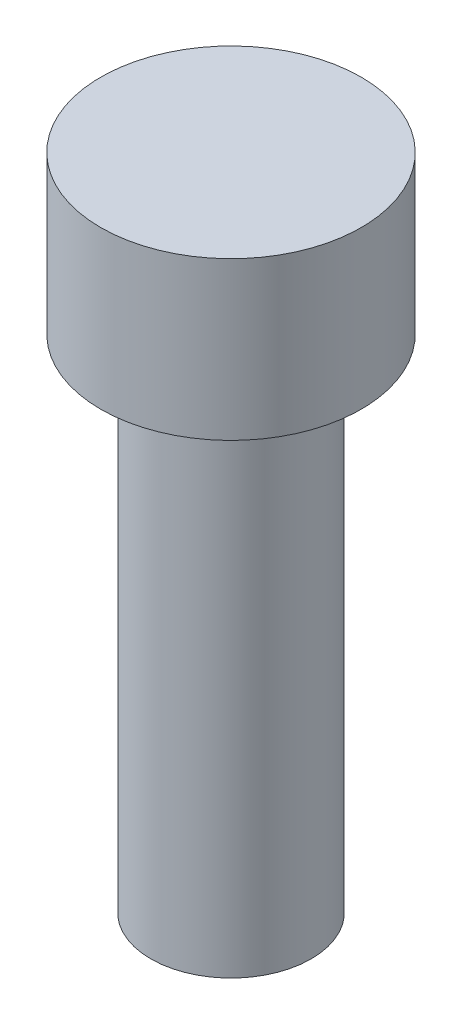
ISO-10303-21;
HEADER;
FILE_DESCRIPTION(('STEP AP214'),'2;1');
FILE_NAME('part.step','',(''),(''),'','','');
FILE_SCHEMA(('AUTOMOTIVE_DESIGN { 1 0 10303 214 1 1 1 1 }'));
ENDSEC;
DATA;
#1=APPLICATION_CONTEXT('core data for automotive mechanical design processes');
#2=APPLICATION_PROTOCOL_DEFINITION('international standard','automotive_design',2000,#1);
#3=PRODUCT_CONTEXT('',#1,'mechanical');
#4=PRODUCT('Part','Part','',(#3));
#5=PRODUCT_RELATED_PRODUCT_CATEGORY('part','',(#4));
#6=PRODUCT_DEFINITION_FORMATION('','',#4);
#7=PRODUCT_DEFINITION_CONTEXT('part definition',#1,'design');
#8=PRODUCT_DEFINITION('design','',#6,#7);
#9=PRODUCT_DEFINITION_SHAPE('','',#8);
#10=(LENGTH_UNIT() NAMED_UNIT(*) SI_UNIT(.MILLI.,.METRE.));
#11=(NAMED_UNIT(*) PLANE_ANGLE_UNIT() SI_UNIT($,.RADIAN.));
#12=(NAMED_UNIT(*) SI_UNIT($,.STERADIAN.) SOLID_ANGLE_UNIT());
#13=UNCERTAINTY_MEASURE_WITH_UNIT(LENGTH_MEASURE(1.E-05),#10,'distance_accuracy_value','');
#14=(GEOMETRIC_REPRESENTATION_CONTEXT(3) GLOBAL_UNCERTAINTY_ASSIGNED_CONTEXT((#13)) GLOBAL_UNIT_ASSIGNED_CONTEXT((#10,
#11,#12)) REPRESENTATION_CONTEXT('',''));
#15=CARTESIAN_POINT('',(0.,0.,0.));
#16=DIRECTION('',(0.,0.,1.));
#17=DIRECTION('',(1.,0.,0.));
#18=AXIS2_PLACEMENT_3D('',#15,#16,#17);
#19=CARTESIAN_POINT('',(0.,0.,0.));
#20=DIRECTION('',(0.,-1.,0.));
#21=DIRECTION('',(0.,0.,-1.));
#22=AXIS2_PLACEMENT_3D('',#19,#20,#21);
#23=PLANE('',#22);
#24=CARTESIAN_POINT('',(0.,0.,0.));
#25=DIRECTION('',(0.,1.,0.));
#26=DIRECTION('',(0.,0.,1.));
#27=AXIS2_PLACEMENT_3D('',#24,#25,#26);
#28=CIRCLE('',#27,6.5);
#29=CARTESIAN_POINT('',(0.,0.,6.5));
#30=VERTEX_POINT('',#29);
#31=EDGE_CURVE('E10',#30,#30,#28,.T.);
#32=ORIENTED_EDGE('',*,*,#31,.T.);
#33=EDGE_LOOP('',(#32));
#34=FACE_BOUND('',#33,.T.);
#35=ADVANCED_FACE('F29',(#34),#23,.F.);
#36=CARTESIAN_POINT('',(0.,0.,0.));
#37=DIRECTION('',(0.,1.,0.));
#38=DIRECTION('',(0.,0.,1.));
#39=AXIS2_PLACEMENT_3D('',#36,#37,#38);
#40=CYLINDRICAL_SURFACE('',#39,6.5);
#41=ORIENTED_EDGE('',*,*,#31,.F.);
#42=EDGE_LOOP('',(#41));
#43=FACE_BOUND('',#42,.T.);
#44=CARTESIAN_POINT('',(0.,-7.85210672201374,0.));
#45=DIRECTION('',(0.,1.,0.));
#46=DIRECTION('',(0.,0.,1.));
#47=AXIS2_PLACEMENT_3D('',#44,#45,#46);
#48=CIRCLE('',#47,6.5);
#49=CARTESIAN_POINT('',(0.,-7.85210672201374,6.5));
#50=VERTEX_POINT('',#49);
#51=EDGE_CURVE('E35',#50,#50,#48,.T.);
#52=ORIENTED_EDGE('',*,*,#51,.T.);
#53=EDGE_LOOP('',(#52));
#54=FACE_BOUND('',#53,.T.);
#55=ADVANCED_FACE('F61',(#43,#54),#40,.T.);
#56=CARTESIAN_POINT('',(6.5,-7.85210672201374,0.));
#57=DIRECTION('',(0.,1.,0.));
#58=DIRECTION('',(0.,0.,1.));
#59=AXIS2_PLACEMENT_3D('',#56,#57,#58);
#60=PLANE('',#59);
#61=ORIENTED_EDGE('',*,*,#51,.F.);
#62=EDGE_LOOP('',(#61));
#63=FACE_BOUND('',#62,.T.);
#64=CARTESIAN_POINT('',(0.,-7.85210672201374,0.));
#65=DIRECTION('',(0.,1.,0.));
#66=DIRECTION('',(0.,0.,1.));
#67=AXIS2_PLACEMENT_3D('',#64,#65,#66);
#68=CIRCLE('',#67,4.);
#69=CARTESIAN_POINT('',(0.,-7.85210672201374,4.));
#70=VERTEX_POINT('',#69);
#71=EDGE_CURVE('E39',#70,#70,#68,.T.);
#72=ORIENTED_EDGE('',*,*,#71,.T.);
#73=EDGE_LOOP('',(#72));
#74=FACE_BOUND('',#73,.T.);
#75=ADVANCED_FACE('F57',(#63,#74),#60,.F.);
#76=CARTESIAN_POINT('',(0.,0.,0.));
#77=DIRECTION('',(0.,1.,0.));
#78=DIRECTION('',(0.,0.,1.));
#79=AXIS2_PLACEMENT_3D('',#76,#77,#78);
#80=CYLINDRICAL_SURFACE('',#79,4.);
#81=ORIENTED_EDGE('',*,*,#71,.F.);
#82=EDGE_LOOP('',(#81));
#83=FACE_BOUND('',#82,.T.);
#84=CARTESIAN_POINT('',(0.,-32.8521067220137,0.));
#85=DIRECTION('',(0.,1.,0.));
#86=DIRECTION('',(0.,0.,1.));
#87=AXIS2_PLACEMENT_3D('',#84,#85,#86);
#88=CIRCLE('',#87,4.);
#89=CARTESIAN_POINT('',(0.,-32.8521067220137,4.));
#90=VERTEX_POINT('',#89);
#91=EDGE_CURVE('E43',#90,#90,#88,.T.);
#92=ORIENTED_EDGE('',*,*,#91,.T.);
#93=EDGE_LOOP('',(#92));
#94=FACE_BOUND('',#93,.T.);
#95=ADVANCED_FACE('F49',(#83,#94),#80,.T.);
#96=CARTESIAN_POINT('',(4.,-32.8521067220137,0.));
#97=DIRECTION('',(0.,1.,0.));
#98=DIRECTION('',(0.,0.,1.));
#99=AXIS2_PLACEMENT_3D('',#96,#97,#98);
#100=PLANE('',#99);
#101=ORIENTED_EDGE('',*,*,#91,.F.);
#102=EDGE_LOOP('',(#101));
#103=FACE_BOUND('',#102,.T.);
#104=ADVANCED_FACE('F51',(#103),#100,.F.);
#105=CLOSED_SHELL('',(#35,#55,#75,#95,#104));
#106=MANIFOLD_SOLID_BREP('B2',#105);
#107=ADVANCED_BREP_SHAPE_REPRESENTATION('',(#18,#106),#14);
#108=SHAPE_DEFINITION_REPRESENTATION(#9,#107);
ENDSEC;
END-ISO-10303-21;
